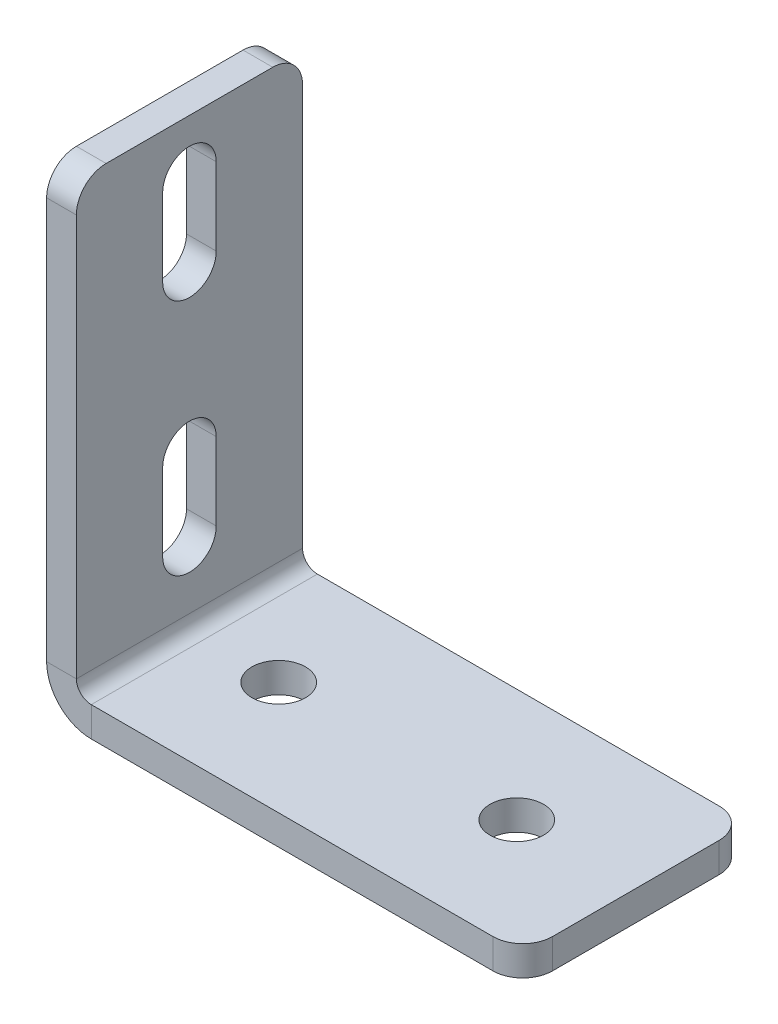
ISO-10303-21;
HEADER;
FILE_DESCRIPTION(('STEP AP214'),'2;1');
FILE_NAME('part.step','',(''),(''),'','','');
FILE_SCHEMA(('AUTOMOTIVE_DESIGN { 1 0 10303 214 1 1 1 1 }'));
ENDSEC;
DATA;
#1=APPLICATION_CONTEXT('core data for automotive mechanical design processes');
#2=APPLICATION_PROTOCOL_DEFINITION('international standard','automotive_design',2000,#1);
#3=PRODUCT_CONTEXT('',#1,'mechanical');
#4=PRODUCT('Part','Part','',(#3));
#5=PRODUCT_RELATED_PRODUCT_CATEGORY('part','',(#4));
#6=PRODUCT_DEFINITION_FORMATION('','',#4);
#7=PRODUCT_DEFINITION_CONTEXT('part definition',#1,'design');
#8=PRODUCT_DEFINITION('design','',#6,#7);
#9=PRODUCT_DEFINITION_SHAPE('','',#8);
#10=(LENGTH_UNIT() NAMED_UNIT(*) SI_UNIT(.MILLI.,.METRE.));
#11=(NAMED_UNIT(*) PLANE_ANGLE_UNIT() SI_UNIT($,.RADIAN.));
#12=(NAMED_UNIT(*) SI_UNIT($,.STERADIAN.) SOLID_ANGLE_UNIT());
#13=UNCERTAINTY_MEASURE_WITH_UNIT(LENGTH_MEASURE(1.E-05),#10,'distance_accuracy_value','');
#14=(GEOMETRIC_REPRESENTATION_CONTEXT(3) GLOBAL_UNCERTAINTY_ASSIGNED_CONTEXT((#13)) GLOBAL_UNIT_ASSIGNED_CONTEXT((#10,
#11,#12)) REPRESENTATION_CONTEXT('',''));
#15=CARTESIAN_POINT('',(0.,0.,0.));
#16=DIRECTION('',(0.,0.,1.));
#17=DIRECTION('',(1.,0.,0.));
#18=AXIS2_PLACEMENT_3D('',#15,#16,#17);
#19=CARTESIAN_POINT('',(0.,58.,0.));
#20=DIRECTION('',(-1.,0.,0.));
#21=DIRECTION('',(0.,0.,1.));
#22=AXIS2_PLACEMENT_3D('',#19,#20,#21);
#23=CYLINDRICAL_SURFACE('',#22,4.5);
#24=CARTESIAN_POINT('',(4.99999999999999,58.,0.));
#25=DIRECTION('',(1.,0.,0.));
#26=DIRECTION('',(0.,0.,-1.));
#27=AXIS2_PLACEMENT_3D('',#24,#25,#26);
#28=CIRCLE('',#27,4.5);
#29=CARTESIAN_POINT('',(5.,58.,4.5));
#30=VERTEX_POINT('',#29);
#31=CARTESIAN_POINT('',(5.,58.,-4.5));
#32=VERTEX_POINT('',#31);
#33=EDGE_CURVE('E351',#30,#32,#28,.T.);
#34=ORIENTED_EDGE('',*,*,#33,.T.);
#35=DIRECTION('',(1.,0.,0.));
#36=VECTOR('',#35,1.);
#37=CARTESIAN_POINT('',(0.,58.,-4.5));
#38=LINE('',#37,#36);
#39=CARTESIAN_POINT('',(0.,58.,-4.5));
#40=VERTEX_POINT('',#39);
#41=EDGE_CURVE('E255',#40,#32,#38,.T.);
#42=ORIENTED_EDGE('',*,*,#41,.F.);
#43=CARTESIAN_POINT('',(0.,58.,0.));
#44=DIRECTION('',(1.,0.,0.));
#45=DIRECTION('',(0.,0.,-1.));
#46=AXIS2_PLACEMENT_3D('',#43,#44,#45);
#47=CIRCLE('',#46,4.5);
#48=CARTESIAN_POINT('',(0.,58.,4.5));
#49=VERTEX_POINT('',#48);
#50=EDGE_CURVE('E264',#49,#40,#47,.T.);
#51=ORIENTED_EDGE('',*,*,#50,.F.);
#52=DIRECTION('',(1.,0.,0.));
#53=VECTOR('',#52,1.);
#54=CARTESIAN_POINT('',(0.,58.,4.5));
#55=LINE('',#54,#53);
#56=EDGE_CURVE('E258',#49,#30,#55,.T.);
#57=ORIENTED_EDGE('',*,*,#56,.T.);
#58=EDGE_LOOP('',(#34,#42,#51,#57));
#59=FACE_BOUND('',#58,.T.);
#60=ADVANCED_FACE('F46',(#59),#23,.F.);
#61=CARTESIAN_POINT('',(0.,18.,0.));
#62=DIRECTION('',(-1.,0.,0.));
#63=DIRECTION('',(0.,0.,1.));
#64=AXIS2_PLACEMENT_3D('',#61,#62,#63);
#65=CYLINDRICAL_SURFACE('',#64,4.5);
#66=CARTESIAN_POINT('',(5.,18.,0.));
#67=DIRECTION('',(1.,0.,0.));
#68=DIRECTION('',(0.,0.,-1.));
#69=AXIS2_PLACEMENT_3D('',#66,#67,#68);
#70=CIRCLE('',#69,4.5);
#71=CARTESIAN_POINT('',(5.,18.,4.5));
#72=VERTEX_POINT('',#71);
#73=CARTESIAN_POINT('',(5.,18.,-4.5));
#74=VERTEX_POINT('',#73);
#75=EDGE_CURVE('E361',#72,#74,#70,.T.);
#76=ORIENTED_EDGE('',*,*,#75,.T.);
#77=DIRECTION('',(1.,0.,0.));
#78=VECTOR('',#77,1.);
#79=CARTESIAN_POINT('',(0.,18.,-4.5));
#80=LINE('',#79,#78);
#81=CARTESIAN_POINT('',(0.,18.,-4.5));
#82=VERTEX_POINT('',#81);
#83=EDGE_CURVE('E226',#82,#74,#80,.T.);
#84=ORIENTED_EDGE('',*,*,#83,.F.);
#85=CARTESIAN_POINT('',(0.,18.,0.));
#86=DIRECTION('',(1.,0.,0.));
#87=DIRECTION('',(0.,0.,-1.));
#88=AXIS2_PLACEMENT_3D('',#85,#86,#87);
#89=CIRCLE('',#88,4.5);
#90=CARTESIAN_POINT('',(0.,18.,4.5));
#91=VERTEX_POINT('',#90);
#92=EDGE_CURVE('E268',#91,#82,#89,.T.);
#93=ORIENTED_EDGE('',*,*,#92,.F.);
#94=DIRECTION('',(1.,0.,0.));
#95=VECTOR('',#94,1.);
#96=CARTESIAN_POINT('',(0.,18.,4.5));
#97=LINE('',#96,#95);
#98=EDGE_CURVE('E191',#91,#72,#97,.T.);
#99=ORIENTED_EDGE('',*,*,#98,.T.);
#100=EDGE_LOOP('',(#76,#84,#93,#99));
#101=FACE_BOUND('',#100,.T.);
#102=ADVANCED_FACE('F507',(#101),#65,.F.);
#103=CARTESIAN_POINT('',(0.,0.,19.));
#104=DIRECTION('',(0.,0.,-1.));
#105=DIRECTION('',(0.,-1.,0.));
#106=AXIS2_PLACEMENT_3D('',#103,#104,#105);
#107=PLANE('',#106);
#108=DIRECTION('',(0.,1.,0.));
#109=VECTOR('',#108,1.);
#110=CARTESIAN_POINT('',(5.,0.,19.));
#111=LINE('',#110,#109);
#112=CARTESIAN_POINT('',(5.,75.,19.));
#113=VERTEX_POINT('',#112);
#114=CARTESIAN_POINT('',(5.,7.5,19.));
#115=VERTEX_POINT('',#114);
#116=EDGE_CURVE('E358',#113,#115,#111,.F.);
#117=ORIENTED_EDGE('',*,*,#116,.F.);
#118=DIRECTION('',(1.,0.,0.));
#119=VECTOR('',#118,1.);
#120=CARTESIAN_POINT('',(0.,75.,19.));
#121=LINE('',#120,#119);
#122=CARTESIAN_POINT('',(0.,75.,19.));
#123=VERTEX_POINT('',#122);
#124=EDGE_CURVE('E11',#113,#123,#121,.F.);
#125=ORIENTED_EDGE('',*,*,#124,.T.);
#126=DIRECTION('',(0.,-1.,0.));
#127=VECTOR('',#126,1.);
#128=CARTESIAN_POINT('',(0.,0.,19.));
#129=LINE('',#128,#127);
#130=CARTESIAN_POINT('',(0.,7.5,19.));
#131=VERTEX_POINT('',#130);
#132=EDGE_CURVE('E272',#123,#131,#129,.T.);
#133=ORIENTED_EDGE('',*,*,#132,.T.);
#134=DIRECTION('',(-1.,0.,0.));
#135=VECTOR('',#134,1.);
#136=CARTESIAN_POINT('',(0.,7.5,19.));
#137=LINE('',#136,#135);
#138=EDGE_CURVE('E378',#115,#131,#137,.T.);
#139=ORIENTED_EDGE('',*,*,#138,.F.);
#140=EDGE_LOOP('',(#117,#125,#133,#139));
#141=FACE_BOUND('',#140,.T.);
#142=ADVANCED_FACE('F464',(#141),#107,.F.);
#143=CARTESIAN_POINT('',(0.,80.,-19.));
#144=DIRECTION('',(0.,-1.,0.));
#145=DIRECTION('',(0.,0.,1.));
#146=AXIS2_PLACEMENT_3D('',#143,#144,#145);
#147=PLANE('',#146);
#148=DIRECTION('',(0.,0.,1.));
#149=VECTOR('',#148,1.);
#150=CARTESIAN_POINT('',(5.,80.,-19.));
#151=LINE('',#150,#149);
#152=CARTESIAN_POINT('',(5.,80.,-14.));
#153=VERTEX_POINT('',#152);
#154=CARTESIAN_POINT('',(5.,80.,14.));
#155=VERTEX_POINT('',#154);
#156=EDGE_CURVE('E354',#153,#155,#151,.T.);
#157=ORIENTED_EDGE('',*,*,#156,.F.);
#158=DIRECTION('',(-1.,0.,0.));
#159=VECTOR('',#158,1.);
#160=CARTESIAN_POINT('',(0.,80.,-14.));
#161=LINE('',#160,#159);
#162=CARTESIAN_POINT('',(0.,80.,-14.));
#163=VERTEX_POINT('',#162);
#164=EDGE_CURVE('E413',#153,#163,#161,.T.);
#165=ORIENTED_EDGE('',*,*,#164,.T.);
#166=DIRECTION('',(0.,0.,1.));
#167=VECTOR('',#166,1.);
#168=CARTESIAN_POINT('',(0.,80.,-19.));
#169=LINE('',#168,#167);
#170=CARTESIAN_POINT('',(0.,80.,14.));
#171=VERTEX_POINT('',#170);
#172=EDGE_CURVE('E275',#163,#171,#169,.T.);
#173=ORIENTED_EDGE('',*,*,#172,.T.);
#174=DIRECTION('',(1.,0.,0.));
#175=VECTOR('',#174,1.);
#176=CARTESIAN_POINT('',(0.,80.,14.));
#177=LINE('',#176,#175);
#178=EDGE_CURVE('E410',#171,#155,#177,.T.);
#179=ORIENTED_EDGE('',*,*,#178,.T.);
#180=EDGE_LOOP('',(#157,#165,#173,#179));
#181=FACE_BOUND('',#180,.T.);
#182=ADVANCED_FACE('F442',(#181),#147,.F.);
#183=CARTESIAN_POINT('',(0.,0.,-19.));
#184=DIRECTION('',(0.,0.,-1.));
#185=DIRECTION('',(0.,-1.,0.));
#186=AXIS2_PLACEMENT_3D('',#183,#184,#185);
#187=PLANE('',#186);
#188=DIRECTION('',(0.,-1.,0.));
#189=VECTOR('',#188,1.);
#190=CARTESIAN_POINT('',(0.,0.,-19.));
#191=LINE('',#190,#189);
#192=CARTESIAN_POINT('',(0.,75.,-19.));
#193=VERTEX_POINT('',#192);
#194=CARTESIAN_POINT('',(0.,7.5,-19.));
#195=VERTEX_POINT('',#194);
#196=EDGE_CURVE('E279',#193,#195,#191,.T.);
#197=ORIENTED_EDGE('',*,*,#196,.F.);
#198=DIRECTION('',(1.,0.,0.));
#199=VECTOR('',#198,1.);
#200=CARTESIAN_POINT('',(0.,75.,-19.));
#201=LINE('',#200,#199);
#202=CARTESIAN_POINT('',(5.,75.,-19.));
#203=VERTEX_POINT('',#202);
#204=EDGE_CURVE('E423',#193,#203,#201,.T.);
#205=ORIENTED_EDGE('',*,*,#204,.T.);
#206=DIRECTION('',(0.,1.,0.));
#207=VECTOR('',#206,1.);
#208=CARTESIAN_POINT('',(5.,0.,-19.));
#209=LINE('',#208,#207);
#210=CARTESIAN_POINT('',(5.,7.5,-19.));
#211=VERTEX_POINT('',#210);
#212=EDGE_CURVE('E332',#203,#211,#209,.F.);
#213=ORIENTED_EDGE('',*,*,#212,.T.);
#214=DIRECTION('',(-1.,0.,0.));
#215=VECTOR('',#214,1.);
#216=CARTESIAN_POINT('',(0.,7.5,-19.));
#217=LINE('',#216,#215);
#218=EDGE_CURVE('E374',#211,#195,#217,.T.);
#219=ORIENTED_EDGE('',*,*,#218,.T.);
#220=EDGE_LOOP('',(#197,#205,#213,#219));
#221=FACE_BOUND('',#220,.T.);
#222=ADVANCED_FACE('F449',(#221),#187,.T.);
#223=CARTESIAN_POINT('',(7.5,7.5,-19.));
#224=DIRECTION('',(0.,0.,1.));
#225=DIRECTION('',(1.,0.,0.));
#226=AXIS2_PLACEMENT_3D('',#223,#224,#225);
#227=PLANE('',#226);
#228=ORIENTED_EDGE('',*,*,#218,.F.);
#229=CARTESIAN_POINT('',(7.5,7.5,-19.));
#230=DIRECTION('',(0.,0.,1.));
#231=DIRECTION('',(1.,0.,0.));
#232=AXIS2_PLACEMENT_3D('',#229,#230,#231);
#233=CIRCLE('',#232,2.5);
#234=CARTESIAN_POINT('',(7.5,5.,-19.));
#235=VERTEX_POINT('',#234);
#236=EDGE_CURVE('E347',#211,#235,#233,.T.);
#237=ORIENTED_EDGE('',*,*,#236,.T.);
#238=DIRECTION('',(0.,-1.,0.));
#239=VECTOR('',#238,1.);
#240=CARTESIAN_POINT('',(7.49999999999999,0.,-19.));
#241=LINE('',#240,#239);
#242=CARTESIAN_POINT('',(7.49999999999999,0.,-19.));
#243=VERTEX_POINT('',#242);
#244=EDGE_CURVE('E371',#235,#243,#241,.T.);
#245=ORIENTED_EDGE('',*,*,#244,.T.);
#246=CARTESIAN_POINT('',(7.5,7.5,-19.));
#247=DIRECTION('',(0.,0.,-1.));
#248=DIRECTION('',(-1.,0.,0.));
#249=AXIS2_PLACEMENT_3D('',#246,#247,#248);
#250=CIRCLE('',#249,7.5);
#251=EDGE_CURVE('E269',#195,#243,#250,.F.);
#252=ORIENTED_EDGE('',*,*,#251,.F.);
#253=EDGE_LOOP('',(#228,#237,#245,#252));
#254=FACE_BOUND('',#253,.T.);
#255=ADVANCED_FACE('F454',(#254),#227,.F.);
#256=CARTESIAN_POINT('',(80.,0.,-19.));
#257=DIRECTION('',(0.,0.,-1.));
#258=DIRECTION('',(1.,0.,0.));
#259=AXIS2_PLACEMENT_3D('',#256,#257,#258);
#260=PLANE('',#259);
#261=DIRECTION('',(1.,0.,0.));
#262=VECTOR('',#261,1.);
#263=CARTESIAN_POINT('',(80.,5.,-19.));
#264=LINE('',#263,#262);
#265=CARTESIAN_POINT('',(75.,5.,-19.));
#266=VERTEX_POINT('',#265);
#267=EDGE_CURVE('E326',#235,#266,#264,.T.);
#268=ORIENTED_EDGE('',*,*,#267,.T.);
#269=DIRECTION('',(0.,-1.,0.));
#270=VECTOR('',#269,1.);
#271=CARTESIAN_POINT('',(75.,0.,-19.));
#272=LINE('',#271,#270);
#273=CARTESIAN_POINT('',(75.,0.,-19.));
#274=VERTEX_POINT('',#273);
#275=EDGE_CURVE('E382',#266,#274,#272,.T.);
#276=ORIENTED_EDGE('',*,*,#275,.T.);
#277=DIRECTION('',(1.,0.,0.));
#278=VECTOR('',#277,1.);
#279=CARTESIAN_POINT('',(80.,0.,-19.));
#280=LINE('',#279,#278);
#281=EDGE_CURVE('E298',#243,#274,#280,.T.);
#282=ORIENTED_EDGE('',*,*,#281,.F.);
#283=ORIENTED_EDGE('',*,*,#244,.F.);
#284=EDGE_LOOP('',(#268,#276,#282,#283));
#285=FACE_BOUND('',#284,.T.);
#286=ADVANCED_FACE('F497',(#285),#260,.T.);
#287=CARTESIAN_POINT('',(80.,0.,-19.));
#288=DIRECTION('',(1.,0.,0.));
#289=DIRECTION('',(0.,0.,1.));
#290=AXIS2_PLACEMENT_3D('',#287,#288,#289);
#291=PLANE('',#290);
#292=DIRECTION('',(0.,0.,1.));
#293=VECTOR('',#292,1.);
#294=CARTESIAN_POINT('',(80.,0.,-19.));
#295=LINE('',#294,#293);
#296=CARTESIAN_POINT('',(80.,0.,-14.));
#297=VERTEX_POINT('',#296);
#298=CARTESIAN_POINT('',(80.,0.,14.));
#299=VERTEX_POINT('',#298);
#300=EDGE_CURVE('E290',#297,#299,#295,.T.);
#301=ORIENTED_EDGE('',*,*,#300,.F.);
#302=DIRECTION('',(0.,-1.,0.));
#303=VECTOR('',#302,1.);
#304=CARTESIAN_POINT('',(80.,0.,-14.));
#305=LINE('',#304,#303);
#306=CARTESIAN_POINT('',(80.,5.,-14.));
#307=VERTEX_POINT('',#306);
#308=EDGE_CURVE('E398',#297,#307,#305,.F.);
#309=ORIENTED_EDGE('',*,*,#308,.T.);
#310=DIRECTION('',(0.,0.,1.));
#311=VECTOR('',#310,1.);
#312=CARTESIAN_POINT('',(80.,5.,-19.));
#313=LINE('',#312,#311);
#314=CARTESIAN_POINT('',(80.,5.,14.));
#315=VERTEX_POINT('',#314);
#316=EDGE_CURVE('E336',#307,#315,#313,.T.);
#317=ORIENTED_EDGE('',*,*,#316,.T.);
#318=DIRECTION('',(0.,1.,0.));
#319=VECTOR('',#318,1.);
#320=CARTESIAN_POINT('',(80.,0.,14.));
#321=LINE('',#320,#319);
#322=EDGE_CURVE('E394',#315,#299,#321,.F.);
#323=ORIENTED_EDGE('',*,*,#322,.T.);
#324=EDGE_LOOP('',(#301,#309,#317,#323));
#325=FACE_BOUND('',#324,.T.);
#326=ADVANCED_FACE('F488',(#325),#291,.T.);
#327=CARTESIAN_POINT('',(80.,0.,19.));
#328=DIRECTION('',(0.,0.,-1.));
#329=DIRECTION('',(1.,0.,0.));
#330=AXIS2_PLACEMENT_3D('',#327,#328,#329);
#331=PLANE('',#330);
#332=DIRECTION('',(1.,0.,0.));
#333=VECTOR('',#332,1.);
#334=CARTESIAN_POINT('',(80.,0.,19.));
#335=LINE('',#334,#333);
#336=CARTESIAN_POINT('',(7.49999999999999,0.,19.));
#337=VERTEX_POINT('',#336);
#338=CARTESIAN_POINT('',(75.,0.,19.));
#339=VERTEX_POINT('',#338);
#340=EDGE_CURVE('E294',#337,#339,#335,.T.);
#341=ORIENTED_EDGE('',*,*,#340,.T.);
#342=DIRECTION('',(0.,-1.,0.));
#343=VECTOR('',#342,1.);
#344=CARTESIAN_POINT('',(75.,0.,19.));
#345=LINE('',#344,#343);
#346=CARTESIAN_POINT('',(75.,5.,19.));
#347=VERTEX_POINT('',#346);
#348=EDGE_CURVE('E407',#339,#347,#345,.F.);
#349=ORIENTED_EDGE('',*,*,#348,.T.);
#350=DIRECTION('',(1.,0.,0.));
#351=VECTOR('',#350,1.);
#352=CARTESIAN_POINT('',(80.,5.,19.));
#353=LINE('',#352,#351);
#354=CARTESIAN_POINT('',(7.49999999999999,5.,19.));
#355=VERTEX_POINT('',#354);
#356=EDGE_CURVE('E337',#355,#347,#353,.T.);
#357=ORIENTED_EDGE('',*,*,#356,.F.);
#358=DIRECTION('',(0.,-1.,0.));
#359=VECTOR('',#358,1.);
#360=CARTESIAN_POINT('',(7.49999999999999,0.,19.));
#361=LINE('',#360,#359);
#362=EDGE_CURVE('E310',#355,#337,#361,.T.);
#363=ORIENTED_EDGE('',*,*,#362,.T.);
#364=EDGE_LOOP('',(#341,#349,#357,#363));
#365=FACE_BOUND('',#364,.T.);
#366=ADVANCED_FACE('F475',(#365),#331,.F.);
#367=CARTESIAN_POINT('',(60.,0.,0.));
#368=DIRECTION('',(0.,-1.,0.));
#369=DIRECTION('',(1.,0.,0.));
#370=AXIS2_PLACEMENT_3D('',#367,#368,#369);
#371=CYLINDRICAL_SURFACE('',#370,4.49999999999999);
#372=CARTESIAN_POINT('',(60.,0.,0.));
#373=DIRECTION('',(0.,-1.,0.));
#374=DIRECTION('',(0.,0.,-1.));
#375=AXIS2_PLACEMENT_3D('',#372,#373,#374);
#376=CIRCLE('',#375,4.49999999999999);
#377=CARTESIAN_POINT('',(60.,0.,-4.49999999999998));
#378=VERTEX_POINT('',#377);
#379=EDGE_CURVE('E282',#378,#378,#376,.T.);
#380=ORIENTED_EDGE('',*,*,#379,.T.);
#381=EDGE_LOOP('',(#380));
#382=FACE_BOUND('',#381,.T.);
#383=CARTESIAN_POINT('',(60.,5.,0.));
#384=DIRECTION('',(0.,-1.,0.));
#385=DIRECTION('',(0.,0.,-1.));
#386=AXIS2_PLACEMENT_3D('',#383,#384,#385);
#387=CIRCLE('',#386,4.49999999999999);
#388=CARTESIAN_POINT('',(60.,5.,-4.49999999999998));
#389=VERTEX_POINT('',#388);
#390=EDGE_CURVE('E327',#389,#389,#387,.T.);
#391=ORIENTED_EDGE('',*,*,#390,.F.);
#392=EDGE_LOOP('',(#391));
#393=FACE_BOUND('',#392,.T.);
#394=ADVANCED_FACE('F555',(#382,#393),#371,.F.);
#395=CARTESIAN_POINT('',(20.,0.,0.));
#396=DIRECTION('',(0.,-1.,0.));
#397=DIRECTION('',(1.,0.,0.));
#398=AXIS2_PLACEMENT_3D('',#395,#396,#397);
#399=CYLINDRICAL_SURFACE('',#398,4.49999999999999);
#400=CARTESIAN_POINT('',(20.,0.,0.));
#401=DIRECTION('',(0.,-1.,0.));
#402=DIRECTION('',(0.,0.,-1.));
#403=AXIS2_PLACEMENT_3D('',#400,#401,#402);
#404=CIRCLE('',#403,4.49999999999999);
#405=CARTESIAN_POINT('',(20.,0.,-4.49999999999999));
#406=VERTEX_POINT('',#405);
#407=EDGE_CURVE('E286',#406,#406,#404,.T.);
#408=ORIENTED_EDGE('',*,*,#407,.T.);
#409=EDGE_LOOP('',(#408));
#410=FACE_BOUND('',#409,.T.);
#411=CARTESIAN_POINT('',(20.,5.,0.));
#412=DIRECTION('',(0.,-1.,0.));
#413=DIRECTION('',(0.,0.,-1.));
#414=AXIS2_PLACEMENT_3D('',#411,#412,#413);
#415=CIRCLE('',#414,4.49999999999999);
#416=CARTESIAN_POINT('',(20.,5.,-4.49999999999999));
#417=VERTEX_POINT('',#416);
#418=EDGE_CURVE('E331',#417,#417,#415,.T.);
#419=ORIENTED_EDGE('',*,*,#418,.F.);
#420=EDGE_LOOP('',(#419));
#421=FACE_BOUND('',#420,.T.);
#422=ADVANCED_FACE('F558',(#410,#421),#399,.F.);
#423=CARTESIAN_POINT('',(7.5,7.5,19.));
#424=DIRECTION('',(0.,0.,-1.));
#425=DIRECTION('',(-1.,0.,0.));
#426=AXIS2_PLACEMENT_3D('',#423,#424,#425);
#427=PLANE('',#426);
#428=CARTESIAN_POINT('',(7.5,7.5,19.));
#429=DIRECTION('',(0.,0.,1.));
#430=DIRECTION('',(1.,0.,0.));
#431=AXIS2_PLACEMENT_3D('',#428,#429,#430);
#432=CIRCLE('',#431,2.5);
#433=EDGE_CURVE('E225',#355,#115,#432,.F.);
#434=ORIENTED_EDGE('',*,*,#433,.T.);
#435=ORIENTED_EDGE('',*,*,#138,.T.);
#436=CARTESIAN_POINT('',(7.5,7.5,19.));
#437=DIRECTION('',(0.,0.,1.));
#438=DIRECTION('',(1.,0.,0.));
#439=AXIS2_PLACEMENT_3D('',#436,#437,#438);
#440=CIRCLE('',#439,7.5);
#441=EDGE_CURVE('E311',#337,#131,#440,.F.);
#442=ORIENTED_EDGE('',*,*,#441,.F.);
#443=ORIENTED_EDGE('',*,*,#362,.F.);
#444=EDGE_LOOP('',(#434,#435,#442,#443));
#445=FACE_BOUND('',#444,.T.);
#446=ADVANCED_FACE('F467',(#445),#427,.F.);
#447=CARTESIAN_POINT('',(80.,0.,-19.));
#448=DIRECTION('',(0.,-1.,0.));
#449=DIRECTION('',(1.,0.,0.));
#450=AXIS2_PLACEMENT_3D('',#447,#448,#449);
#451=PLANE('',#450);
#452=ORIENTED_EDGE('',*,*,#379,.F.);
#453=EDGE_LOOP('',(#452));
#454=FACE_BOUND('',#453,.T.);
#455=ORIENTED_EDGE('',*,*,#407,.F.);
#456=EDGE_LOOP('',(#455));
#457=FACE_BOUND('',#456,.T.);
#458=ORIENTED_EDGE('',*,*,#281,.T.);
#459=CARTESIAN_POINT('',(75.,0.,-14.));
#460=DIRECTION('',(0.,-1.,0.));
#461=DIRECTION('',(1.,0.,0.));
#462=AXIS2_PLACEMENT_3D('',#459,#460,#461);
#463=CIRCLE('',#462,5.);
#464=EDGE_CURVE('E391',#274,#297,#463,.T.);
#465=ORIENTED_EDGE('',*,*,#464,.T.);
#466=ORIENTED_EDGE('',*,*,#300,.T.);
#467=CARTESIAN_POINT('',(75.,0.,14.));
#468=DIRECTION('',(0.,-1.,0.));
#469=DIRECTION('',(1.,0.,0.));
#470=AXIS2_PLACEMENT_3D('',#467,#468,#469);
#471=CIRCLE('',#470,5.);
#472=EDGE_CURVE('E388',#299,#339,#471,.T.);
#473=ORIENTED_EDGE('',*,*,#472,.T.);
#474=ORIENTED_EDGE('',*,*,#340,.F.);
#475=DIRECTION('',(0.,0.,1.));
#476=VECTOR('',#475,1.);
#477=CARTESIAN_POINT('',(7.49999999999999,0.,-19.));
#478=LINE('',#477,#476);
#479=EDGE_CURVE('E306',#337,#243,#478,.F.);
#480=ORIENTED_EDGE('',*,*,#479,.T.);
#481=EDGE_LOOP('',(#458,#465,#466,#473,#474,#480));
#482=FACE_BOUND('',#481,.T.);
#483=ADVANCED_FACE('F491',(#454,#457,#482),#451,.T.);
#484=CARTESIAN_POINT('',(0.,0.,-19.));
#485=DIRECTION('',(-1.,0.,0.));
#486=DIRECTION('',(0.,0.,1.));
#487=AXIS2_PLACEMENT_3D('',#484,#485,#486);
#488=PLANE('',#487);
#489=DIRECTION('',(0.,1.,0.));
#490=VECTOR('',#489,1.);
#491=CARTESIAN_POINT('',(0.,31.,-4.5));
#492=LINE('',#491,#490);
#493=CARTESIAN_POINT('',(0.,31.,-4.5));
#494=VERTEX_POINT('',#493);
#495=EDGE_CURVE('E192',#82,#494,#492,.T.);
#496=ORIENTED_EDGE('',*,*,#495,.T.);
#497=CARTESIAN_POINT('',(0.,31.,0.));
#498=DIRECTION('',(1.,0.,0.));
#499=DIRECTION('',(0.,0.,-1.));
#500=AXIS2_PLACEMENT_3D('',#497,#498,#499);
#501=CIRCLE('',#500,4.5);
#502=CARTESIAN_POINT('',(0.,31.,4.5));
#503=VERTEX_POINT('',#502);
#504=EDGE_CURVE('E186',#494,#503,#501,.T.);
#505=ORIENTED_EDGE('',*,*,#504,.T.);
#506=DIRECTION('',(0.,-1.,0.));
#507=VECTOR('',#506,1.);
#508=CARTESIAN_POINT('',(0.,31.,4.5));
#509=LINE('',#508,#507);
#510=EDGE_CURVE('E195',#503,#91,#509,.T.);
#511=ORIENTED_EDGE('',*,*,#510,.T.);
#512=ORIENTED_EDGE('',*,*,#92,.T.);
#513=EDGE_LOOP('',(#496,#505,#511,#512));
#514=FACE_BOUND('',#513,.T.);
#515=DIRECTION('',(0.,1.,0.));
#516=VECTOR('',#515,1.);
#517=CARTESIAN_POINT('',(0.,71.,-4.5));
#518=LINE('',#517,#516);
#519=CARTESIAN_POINT('',(0.,71.,-4.5));
#520=VERTEX_POINT('',#519);
#521=EDGE_CURVE('E240',#40,#520,#518,.T.);
#522=ORIENTED_EDGE('',*,*,#521,.T.);
#523=CARTESIAN_POINT('',(0.,71.,0.));
#524=DIRECTION('',(1.,0.,0.));
#525=DIRECTION('',(0.,0.,-1.));
#526=AXIS2_PLACEMENT_3D('',#523,#524,#525);
#527=CIRCLE('',#526,4.5);
#528=CARTESIAN_POINT('',(0.,71.,4.5));
#529=VERTEX_POINT('',#528);
#530=EDGE_CURVE('E231',#520,#529,#527,.T.);
#531=ORIENTED_EDGE('',*,*,#530,.T.);
#532=DIRECTION('',(0.,-1.,0.));
#533=VECTOR('',#532,1.);
#534=CARTESIAN_POINT('',(0.,71.,4.5));
#535=LINE('',#534,#533);
#536=EDGE_CURVE('E235',#529,#49,#535,.T.);
#537=ORIENTED_EDGE('',*,*,#536,.T.);
#538=ORIENTED_EDGE('',*,*,#50,.T.);
#539=EDGE_LOOP('',(#522,#531,#537,#538));
#540=FACE_BOUND('',#539,.T.);
#541=ORIENTED_EDGE('',*,*,#172,.F.);
#542=CARTESIAN_POINT('',(0.,75.,-14.));
#543=DIRECTION('',(-1.,0.,0.));
#544=DIRECTION('',(0.,0.,1.));
#545=AXIS2_PLACEMENT_3D('',#542,#543,#544);
#546=CIRCLE('',#545,5.);
#547=EDGE_CURVE('E420',#163,#193,#546,.T.);
#548=ORIENTED_EDGE('',*,*,#547,.T.);
#549=ORIENTED_EDGE('',*,*,#196,.T.);
#550=DIRECTION('',(0.,0.,1.));
#551=VECTOR('',#550,1.);
#552=CARTESIAN_POINT('',(0.,7.5,-19.));
#553=LINE('',#552,#551);
#554=EDGE_CURVE('E302',#195,#131,#553,.T.);
#555=ORIENTED_EDGE('',*,*,#554,.T.);
#556=ORIENTED_EDGE('',*,*,#132,.F.);
#557=CARTESIAN_POINT('',(0.,75.,14.));
#558=DIRECTION('',(-1.,0.,0.));
#559=DIRECTION('',(0.,0.,1.));
#560=AXIS2_PLACEMENT_3D('',#557,#558,#559);
#561=CIRCLE('',#560,5.);
#562=EDGE_CURVE('E417',#123,#171,#561,.T.);
#563=ORIENTED_EDGE('',*,*,#562,.T.);
#564=EDGE_LOOP('',(#541,#548,#549,#555,#556,#563));
#565=FACE_BOUND('',#564,.T.);
#566=ADVANCED_FACE('F203',(#514,#540,#565),#488,.T.);
#567=CARTESIAN_POINT('',(7.5,7.5,-19.));
#568=DIRECTION('',(0.,0.,1.));
#569=DIRECTION('',(1.,0.,0.));
#570=AXIS2_PLACEMENT_3D('',#567,#568,#569);
#571=CYLINDRICAL_SURFACE('',#570,7.5);
#572=ORIENTED_EDGE('',*,*,#251,.T.);
#573=ORIENTED_EDGE('',*,*,#479,.F.);
#574=ORIENTED_EDGE('',*,*,#441,.T.);
#575=ORIENTED_EDGE('',*,*,#554,.F.);
#576=EDGE_LOOP('',(#572,#573,#574,#575));
#577=FACE_BOUND('',#576,.T.);
#578=ADVANCED_FACE('F458',(#577),#571,.T.);
#579=CARTESIAN_POINT('',(80.,5.,-19.));
#580=DIRECTION('',(0.,-1.,0.));
#581=DIRECTION('',(1.,0.,0.));
#582=AXIS2_PLACEMENT_3D('',#579,#580,#581);
#583=PLANE('',#582);
#584=ORIENTED_EDGE('',*,*,#390,.T.);
#585=EDGE_LOOP('',(#584));
#586=FACE_BOUND('',#585,.T.);
#587=ORIENTED_EDGE('',*,*,#418,.T.);
#588=EDGE_LOOP('',(#587));
#589=FACE_BOUND('',#588,.T.);
#590=ORIENTED_EDGE('',*,*,#316,.F.);
#591=CARTESIAN_POINT('',(75.,5.,-14.));
#592=DIRECTION('',(0.,-1.,0.));
#593=DIRECTION('',(1.,0.,0.));
#594=AXIS2_PLACEMENT_3D('',#591,#592,#593);
#595=CIRCLE('',#594,5.);
#596=EDGE_CURVE('E404',#307,#266,#595,.F.);
#597=ORIENTED_EDGE('',*,*,#596,.T.);
#598=ORIENTED_EDGE('',*,*,#267,.F.);
#599=DIRECTION('',(0.,0.,1.));
#600=VECTOR('',#599,1.);
#601=CARTESIAN_POINT('',(7.49999999999999,5.,-19.));
#602=LINE('',#601,#600);
#603=EDGE_CURVE('E315',#355,#235,#602,.F.);
#604=ORIENTED_EDGE('',*,*,#603,.F.);
#605=ORIENTED_EDGE('',*,*,#356,.T.);
#606=CARTESIAN_POINT('',(75.,5.,14.));
#607=DIRECTION('',(0.,-1.,0.));
#608=DIRECTION('',(1.,0.,0.));
#609=AXIS2_PLACEMENT_3D('',#606,#607,#608);
#610=CIRCLE('',#609,5.);
#611=EDGE_CURVE('E401',#347,#315,#610,.F.);
#612=ORIENTED_EDGE('',*,*,#611,.T.);
#613=EDGE_LOOP('',(#590,#597,#598,#604,#605,#612));
#614=FACE_BOUND('',#613,.T.);
#615=ADVANCED_FACE('F481',(#586,#589,#614),#583,.F.);
#616=CARTESIAN_POINT('',(5.,0.,-19.));
#617=DIRECTION('',(-1.,0.,0.));
#618=DIRECTION('',(0.,0.,1.));
#619=AXIS2_PLACEMENT_3D('',#616,#617,#618);
#620=PLANE('',#619);
#621=CARTESIAN_POINT('',(5.,71.,0.));
#622=DIRECTION('',(1.,0.,0.));
#623=DIRECTION('',(0.,0.,-1.));
#624=AXIS2_PLACEMENT_3D('',#621,#622,#623);
#625=CIRCLE('',#624,4.5);
#626=CARTESIAN_POINT('',(5.,71.,-4.5));
#627=VERTEX_POINT('',#626);
#628=CARTESIAN_POINT('',(5.,71.,4.5));
#629=VERTEX_POINT('',#628);
#630=EDGE_CURVE('E70',#627,#629,#625,.T.);
#631=ORIENTED_EDGE('',*,*,#630,.F.);
#632=DIRECTION('',(0.,1.,0.));
#633=VECTOR('',#632,1.);
#634=CARTESIAN_POINT('',(5.,71.,-4.5));
#635=LINE('',#634,#633);
#636=EDGE_CURVE('E236',#32,#627,#635,.T.);
#637=ORIENTED_EDGE('',*,*,#636,.F.);
#638=ORIENTED_EDGE('',*,*,#33,.F.);
#639=DIRECTION('',(0.,-1.,0.));
#640=VECTOR('',#639,1.);
#641=CARTESIAN_POINT('',(5.,71.,4.5));
#642=LINE('',#641,#640);
#643=EDGE_CURVE('E247',#629,#30,#642,.T.);
#644=ORIENTED_EDGE('',*,*,#643,.F.);
#645=EDGE_LOOP('',(#631,#637,#638,#644));
#646=FACE_BOUND('',#645,.T.);
#647=CARTESIAN_POINT('',(5.,31.,0.));
#648=DIRECTION('',(1.,0.,0.));
#649=DIRECTION('',(0.,0.,-1.));
#650=AXIS2_PLACEMENT_3D('',#647,#648,#649);
#651=CIRCLE('',#650,4.5);
#652=CARTESIAN_POINT('',(5.,31.,-4.5));
#653=VERTEX_POINT('',#652);
#654=CARTESIAN_POINT('',(5.,31.,4.5));
#655=VERTEX_POINT('',#654);
#656=EDGE_CURVE('E62',#653,#655,#651,.T.);
#657=ORIENTED_EDGE('',*,*,#656,.F.);
#658=DIRECTION('',(0.,1.,0.));
#659=VECTOR('',#658,1.);
#660=CARTESIAN_POINT('',(5.,31.,-4.5));
#661=LINE('',#660,#659);
#662=EDGE_CURVE('E206',#74,#653,#661,.T.);
#663=ORIENTED_EDGE('',*,*,#662,.F.);
#664=ORIENTED_EDGE('',*,*,#75,.F.);
#665=DIRECTION('',(0.,-1.,0.));
#666=VECTOR('',#665,1.);
#667=CARTESIAN_POINT('',(5.,31.,4.5));
#668=LINE('',#667,#666);
#669=EDGE_CURVE('E212',#655,#72,#668,.T.);
#670=ORIENTED_EDGE('',*,*,#669,.F.);
#671=EDGE_LOOP('',(#657,#663,#664,#670));
#672=FACE_BOUND('',#671,.T.);
#673=ORIENTED_EDGE('',*,*,#212,.F.);
#674=CARTESIAN_POINT('',(5.,75.,-14.));
#675=DIRECTION('',(-1.,0.,0.));
#676=DIRECTION('',(0.,0.,1.));
#677=AXIS2_PLACEMENT_3D('',#674,#675,#676);
#678=CIRCLE('',#677,5.);
#679=EDGE_CURVE('E55',#203,#153,#678,.F.);
#680=ORIENTED_EDGE('',*,*,#679,.T.);
#681=ORIENTED_EDGE('',*,*,#156,.T.);
#682=CARTESIAN_POINT('',(5.,75.,14.));
#683=DIRECTION('',(-1.,0.,0.));
#684=DIRECTION('',(0.,0.,1.));
#685=AXIS2_PLACEMENT_3D('',#682,#683,#684);
#686=CIRCLE('',#685,5.);
#687=EDGE_CURVE('E426',#155,#113,#686,.F.);
#688=ORIENTED_EDGE('',*,*,#687,.T.);
#689=ORIENTED_EDGE('',*,*,#116,.T.);
#690=DIRECTION('',(0.,0.,1.));
#691=VECTOR('',#690,1.);
#692=CARTESIAN_POINT('',(5.,7.5,-19.));
#693=LINE('',#692,#691);
#694=EDGE_CURVE('E322',#211,#115,#693,.T.);
#695=ORIENTED_EDGE('',*,*,#694,.F.);
#696=EDGE_LOOP('',(#673,#680,#681,#688,#689,#695));
#697=FACE_BOUND('',#696,.T.);
#698=ADVANCED_FACE('F435',(#646,#672,#697),#620,.F.);
#699=CARTESIAN_POINT('',(7.5,7.5,-19.));
#700=DIRECTION('',(0.,0.,1.));
#701=DIRECTION('',(1.,0.,0.));
#702=AXIS2_PLACEMENT_3D('',#699,#700,#701);
#703=CYLINDRICAL_SURFACE('',#702,2.5);
#704=ORIENTED_EDGE('',*,*,#236,.F.);
#705=ORIENTED_EDGE('',*,*,#694,.T.);
#706=ORIENTED_EDGE('',*,*,#433,.F.);
#707=ORIENTED_EDGE('',*,*,#603,.T.);
#708=EDGE_LOOP('',(#704,#705,#706,#707));
#709=FACE_BOUND('',#708,.T.);
#710=ADVANCED_FACE('F473',(#709),#703,.F.);
#711=CARTESIAN_POINT('',(75.,0.,-14.));
#712=DIRECTION('',(0.,-1.,0.));
#713=DIRECTION('',(1.,0.,0.));
#714=AXIS2_PLACEMENT_3D('',#711,#712,#713);
#715=CYLINDRICAL_SURFACE('',#714,5.);
#716=ORIENTED_EDGE('',*,*,#596,.F.);
#717=ORIENTED_EDGE('',*,*,#308,.F.);
#718=ORIENTED_EDGE('',*,*,#464,.F.);
#719=ORIENTED_EDGE('',*,*,#275,.F.);
#720=EDGE_LOOP('',(#716,#717,#718,#719));
#721=FACE_BOUND('',#720,.T.);
#722=ADVANCED_FACE('F495',(#721),#715,.T.);
#723=CARTESIAN_POINT('',(75.,0.,14.));
#724=DIRECTION('',(0.,1.,0.));
#725=DIRECTION('',(-1.,0.,0.));
#726=AXIS2_PLACEMENT_3D('',#723,#724,#725);
#727=CYLINDRICAL_SURFACE('',#726,5.);
#728=ORIENTED_EDGE('',*,*,#611,.F.);
#729=ORIENTED_EDGE('',*,*,#348,.F.);
#730=ORIENTED_EDGE('',*,*,#472,.F.);
#731=ORIENTED_EDGE('',*,*,#322,.F.);
#732=EDGE_LOOP('',(#728,#729,#730,#731));
#733=FACE_BOUND('',#732,.T.);
#734=ADVANCED_FACE('F485',(#733),#727,.T.);
#735=CARTESIAN_POINT('',(0.,75.,-14.));
#736=DIRECTION('',(1.,0.,0.));
#737=DIRECTION('',(0.,0.,-1.));
#738=AXIS2_PLACEMENT_3D('',#735,#736,#737);
#739=CYLINDRICAL_SURFACE('',#738,5.);
#740=ORIENTED_EDGE('',*,*,#679,.F.);
#741=ORIENTED_EDGE('',*,*,#204,.F.);
#742=ORIENTED_EDGE('',*,*,#547,.F.);
#743=ORIENTED_EDGE('',*,*,#164,.F.);
#744=EDGE_LOOP('',(#740,#741,#742,#743));
#745=FACE_BOUND('',#744,.T.);
#746=ADVANCED_FACE('F445',(#745),#739,.T.);
#747=CARTESIAN_POINT('',(0.,75.,14.));
#748=DIRECTION('',(-1.,0.,0.));
#749=DIRECTION('',(0.,0.,1.));
#750=AXIS2_PLACEMENT_3D('',#747,#748,#749);
#751=CYLINDRICAL_SURFACE('',#750,5.);
#752=ORIENTED_EDGE('',*,*,#687,.F.);
#753=ORIENTED_EDGE('',*,*,#178,.F.);
#754=ORIENTED_EDGE('',*,*,#562,.F.);
#755=ORIENTED_EDGE('',*,*,#124,.F.);
#756=EDGE_LOOP('',(#752,#753,#754,#755));
#757=FACE_BOUND('',#756,.T.);
#758=ADVANCED_FACE('F48',(#757),#751,.T.);
#759=CARTESIAN_POINT('',(0.,71.,0.));
#760=DIRECTION('',(1.,0.,0.));
#761=DIRECTION('',(0.,0.,-1.));
#762=AXIS2_PLACEMENT_3D('',#759,#760,#761);
#763=CYLINDRICAL_SURFACE('',#762,4.5);
#764=ORIENTED_EDGE('',*,*,#630,.T.);
#765=DIRECTION('',(1.,0.,0.));
#766=VECTOR('',#765,1.);
#767=CARTESIAN_POINT('',(0.,71.,4.5));
#768=LINE('',#767,#766);
#769=EDGE_CURVE('E244',#529,#629,#768,.T.);
#770=ORIENTED_EDGE('',*,*,#769,.F.);
#771=ORIENTED_EDGE('',*,*,#530,.F.);
#772=DIRECTION('',(1.,0.,0.));
#773=VECTOR('',#772,1.);
#774=CARTESIAN_POINT('',(0.,71.,-4.5));
#775=LINE('',#774,#773);
#776=EDGE_CURVE('E219',#520,#627,#775,.T.);
#777=ORIENTED_EDGE('',*,*,#776,.T.);
#778=EDGE_LOOP('',(#764,#770,#771,#777));
#779=FACE_BOUND('',#778,.T.);
#780=ADVANCED_FACE('F525',(#779),#763,.F.);
#781=CARTESIAN_POINT('',(0.,71.,-4.5));
#782=DIRECTION('',(0.,0.,-1.));
#783=DIRECTION('',(0.,1.,0.));
#784=AXIS2_PLACEMENT_3D('',#781,#782,#783);
#785=PLANE('',#784);
#786=ORIENTED_EDGE('',*,*,#636,.T.);
#787=ORIENTED_EDGE('',*,*,#776,.F.);
#788=ORIENTED_EDGE('',*,*,#521,.F.);
#789=ORIENTED_EDGE('',*,*,#41,.T.);
#790=EDGE_LOOP('',(#786,#787,#788,#789));
#791=FACE_BOUND('',#790,.T.);
#792=ADVANCED_FACE('F530',(#791),#785,.F.);
#793=CARTESIAN_POINT('',(0.,71.,4.5));
#794=DIRECTION('',(0.,0.,1.));
#795=DIRECTION('',(0.,-1.,0.));
#796=AXIS2_PLACEMENT_3D('',#793,#794,#795);
#797=PLANE('',#796);
#798=ORIENTED_EDGE('',*,*,#643,.T.);
#799=ORIENTED_EDGE('',*,*,#56,.F.);
#800=ORIENTED_EDGE('',*,*,#536,.F.);
#801=ORIENTED_EDGE('',*,*,#769,.T.);
#802=EDGE_LOOP('',(#798,#799,#800,#801));
#803=FACE_BOUND('',#802,.T.);
#804=ADVANCED_FACE('F535',(#803),#797,.F.);
#805=CARTESIAN_POINT('',(0.,31.,0.));
#806=DIRECTION('',(1.,0.,0.));
#807=DIRECTION('',(0.,0.,-1.));
#808=AXIS2_PLACEMENT_3D('',#805,#806,#807);
#809=CYLINDRICAL_SURFACE('',#808,4.5);
#810=ORIENTED_EDGE('',*,*,#656,.T.);
#811=DIRECTION('',(1.,0.,0.));
#812=VECTOR('',#811,1.);
#813=CARTESIAN_POINT('',(0.,31.,4.5));
#814=LINE('',#813,#812);
#815=EDGE_CURVE('E182',#503,#655,#814,.T.);
#816=ORIENTED_EDGE('',*,*,#815,.F.);
#817=ORIENTED_EDGE('',*,*,#504,.F.);
#818=DIRECTION('',(1.,0.,0.));
#819=VECTOR('',#818,1.);
#820=CARTESIAN_POINT('',(0.,31.,-4.5));
#821=LINE('',#820,#819);
#822=EDGE_CURVE('E222',#494,#653,#821,.T.);
#823=ORIENTED_EDGE('',*,*,#822,.T.);
#824=EDGE_LOOP('',(#810,#816,#817,#823));
#825=FACE_BOUND('',#824,.T.);
#826=ADVANCED_FACE('F184',(#825),#809,.F.);
#827=CARTESIAN_POINT('',(0.,31.,-4.5));
#828=DIRECTION('',(0.,0.,-1.));
#829=DIRECTION('',(0.,1.,0.));
#830=AXIS2_PLACEMENT_3D('',#827,#828,#829);
#831=PLANE('',#830);
#832=ORIENTED_EDGE('',*,*,#662,.T.);
#833=ORIENTED_EDGE('',*,*,#822,.F.);
#834=ORIENTED_EDGE('',*,*,#495,.F.);
#835=ORIENTED_EDGE('',*,*,#83,.T.);
#836=EDGE_LOOP('',(#832,#833,#834,#835));
#837=FACE_BOUND('',#836,.T.);
#838=ADVANCED_FACE('F649',(#837),#831,.F.);
#839=CARTESIAN_POINT('',(0.,31.,4.5));
#840=DIRECTION('',(0.,0.,1.));
#841=DIRECTION('',(0.,-1.,0.));
#842=AXIS2_PLACEMENT_3D('',#839,#840,#841);
#843=PLANE('',#842);
#844=ORIENTED_EDGE('',*,*,#669,.T.);
#845=ORIENTED_EDGE('',*,*,#98,.F.);
#846=ORIENTED_EDGE('',*,*,#510,.F.);
#847=ORIENTED_EDGE('',*,*,#815,.T.);
#848=EDGE_LOOP('',(#844,#845,#846,#847));
#849=FACE_BOUND('',#848,.T.);
#850=ADVANCED_FACE('F196',(#849),#843,.F.);
#851=CLOSED_SHELL('',(#60,#102,#142,#182,#222,#255,#286,#326,#366,#394,#422,#446,#483,#566,#578,
#615,#698,#710,#722,#734,#746,#758,#780,#792,#804,#826,#838,#850));
#852=MANIFOLD_SOLID_BREP('B2',#851);
#853=ADVANCED_BREP_SHAPE_REPRESENTATION('',(#18,#852),#14);
#854=SHAPE_DEFINITION_REPRESENTATION(#9,#853);
ENDSEC;
END-ISO-10303-21;
